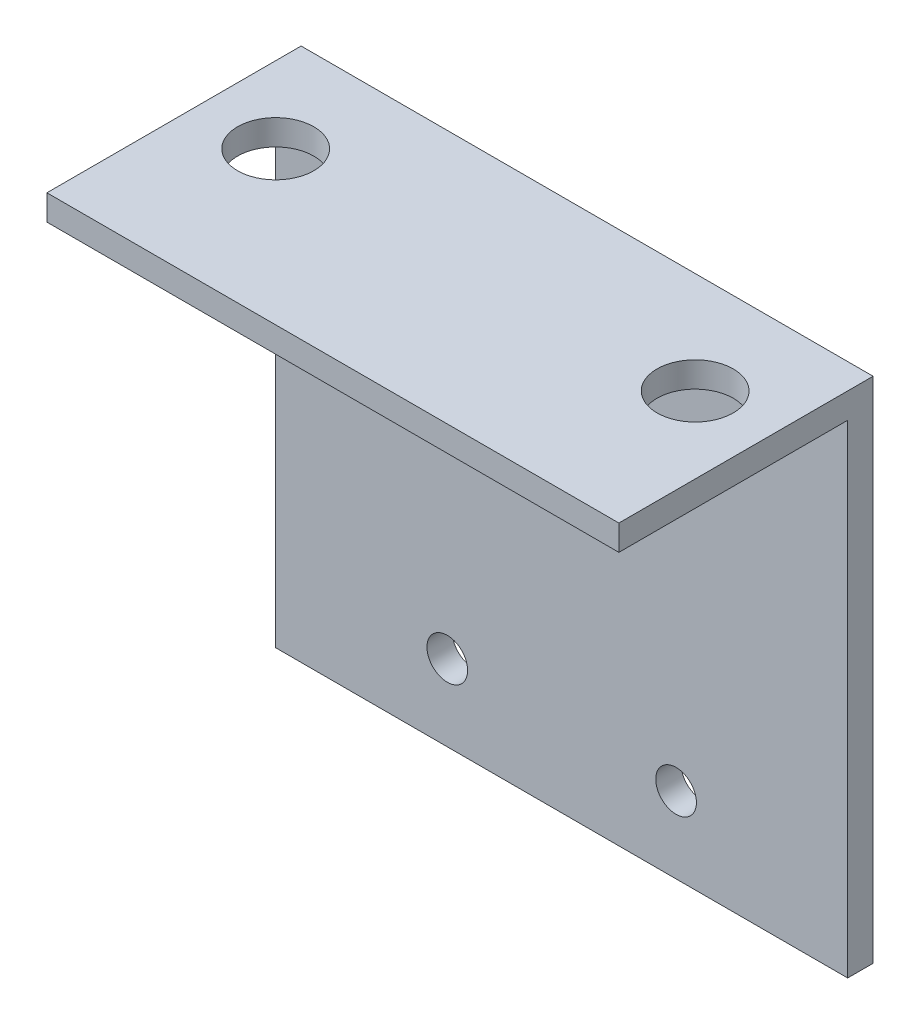
ISO-10303-21;
HEADER;
FILE_DESCRIPTION(('STEP AP214'),'2;1');
FILE_NAME('part.step','',(''),(''),'','','');
FILE_SCHEMA(('AUTOMOTIVE_DESIGN { 1 0 10303 214 1 1 1 1 }'));
ENDSEC;
DATA;
#1=APPLICATION_CONTEXT('core data for automotive mechanical design processes');
#2=APPLICATION_PROTOCOL_DEFINITION('international standard','automotive_design',2000,#1);
#3=PRODUCT_CONTEXT('',#1,'mechanical');
#4=PRODUCT('Part','Part','',(#3));
#5=PRODUCT_RELATED_PRODUCT_CATEGORY('part','',(#4));
#6=PRODUCT_DEFINITION_FORMATION('','',#4);
#7=PRODUCT_DEFINITION_CONTEXT('part definition',#1,'design');
#8=PRODUCT_DEFINITION('design','',#6,#7);
#9=PRODUCT_DEFINITION_SHAPE('','',#8);
#10=(LENGTH_UNIT() NAMED_UNIT(*) SI_UNIT(.MILLI.,.METRE.));
#11=(NAMED_UNIT(*) PLANE_ANGLE_UNIT() SI_UNIT($,.RADIAN.));
#12=(NAMED_UNIT(*) SI_UNIT($,.STERADIAN.) SOLID_ANGLE_UNIT());
#13=UNCERTAINTY_MEASURE_WITH_UNIT(LENGTH_MEASURE(1.E-05),#10,'distance_accuracy_value','');
#14=(GEOMETRIC_REPRESENTATION_CONTEXT(3) GLOBAL_UNCERTAINTY_ASSIGNED_CONTEXT((#13)) GLOBAL_UNIT_ASSIGNED_CONTEXT((#10,
#11,#12)) REPRESENTATION_CONTEXT('',''));
#15=CARTESIAN_POINT('',(0.,0.,0.));
#16=DIRECTION('',(0.,0.,1.));
#17=DIRECTION('',(1.,0.,0.));
#18=AXIS2_PLACEMENT_3D('',#15,#16,#17);
#19=CARTESIAN_POINT('',(45.,40.,-2.));
#20=DIRECTION('',(0.,-1.,0.));
#21=DIRECTION('',(0.,0.,-1.));
#22=AXIS2_PLACEMENT_3D('',#19,#20,#21);
#23=PLANE('',#22);
#24=CARTESIAN_POINT('',(39.,40.,6.));
#25=DIRECTION('',(0.,-1.,0.));
#26=DIRECTION('',(0.,0.,-1.));
#27=AXIS2_PLACEMENT_3D('',#24,#25,#26);
#28=CIRCLE('',#27,3.);
#29=CARTESIAN_POINT('',(39.,40.,3.));
#30=VERTEX_POINT('',#29);
#31=EDGE_CURVE('E122',#30,#30,#28,.T.);
#32=ORIENTED_EDGE('',*,*,#31,.T.);
#33=EDGE_LOOP('',(#32));
#34=FACE_BOUND('',#33,.T.);
#35=CARTESIAN_POINT('',(6.,40.,6.));
#36=DIRECTION('',(0.,-1.,0.));
#37=DIRECTION('',(0.,0.,-1.));
#38=AXIS2_PLACEMENT_3D('',#35,#36,#37);
#39=CIRCLE('',#38,3.);
#40=CARTESIAN_POINT('',(6.,40.,3.));
#41=VERTEX_POINT('',#40);
#42=EDGE_CURVE('E166',#41,#41,#39,.T.);
#43=ORIENTED_EDGE('',*,*,#42,.T.);
#44=EDGE_LOOP('',(#43));
#45=FACE_BOUND('',#44,.T.);
#46=DIRECTION('',(0.,0.,1.));
#47=VECTOR('',#46,1.);
#48=CARTESIAN_POINT('',(0.,40.,-2.));
#49=LINE('',#48,#47);
#50=CARTESIAN_POINT('',(0.,40.,-2.));
#51=VERTEX_POINT('',#50);
#52=CARTESIAN_POINT('',(0.,40.,18.));
#53=VERTEX_POINT('',#52);
#54=EDGE_CURVE('E118',#51,#53,#49,.T.);
#55=ORIENTED_EDGE('',*,*,#54,.T.);
#56=DIRECTION('',(-1.,0.,0.));
#57=VECTOR('',#56,1.);
#58=CARTESIAN_POINT('',(45.,40.,18.));
#59=LINE('',#58,#57);
#60=CARTESIAN_POINT('',(45.,40.,18.));
#61=VERTEX_POINT('',#60);
#62=EDGE_CURVE('E11',#61,#53,#59,.T.);
#63=ORIENTED_EDGE('',*,*,#62,.F.);
#64=DIRECTION('',(0.,0.,1.));
#65=VECTOR('',#64,1.);
#66=CARTESIAN_POINT('',(45.,40.,-2.));
#67=LINE('',#66,#65);
#68=CARTESIAN_POINT('',(45.,40.,-2.));
#69=VERTEX_POINT('',#68);
#70=EDGE_CURVE('E129',#69,#61,#67,.T.);
#71=ORIENTED_EDGE('',*,*,#70,.F.);
#72=DIRECTION('',(-1.,0.,0.));
#73=VECTOR('',#72,1.);
#74=CARTESIAN_POINT('',(45.,40.,-2.));
#75=LINE('',#74,#73);
#76=EDGE_CURVE('E114',#69,#51,#75,.T.);
#77=ORIENTED_EDGE('',*,*,#76,.T.);
#78=EDGE_LOOP('',(#55,#63,#71,#77));
#79=FACE_BOUND('',#78,.T.);
#80=ADVANCED_FACE('F34',(#34,#45,#79),#23,.F.);
#81=CARTESIAN_POINT('',(45.,40.,18.));
#82=DIRECTION('',(0.,0.,-1.));
#83=DIRECTION('',(-1.,0.,0.));
#84=AXIS2_PLACEMENT_3D('',#81,#82,#83);
#85=PLANE('',#84);
#86=DIRECTION('',(0.,-1.,0.));
#87=VECTOR('',#86,1.);
#88=CARTESIAN_POINT('',(0.,40.,18.));
#89=LINE('',#88,#87);
#90=CARTESIAN_POINT('',(0.,38.,18.));
#91=VERTEX_POINT('',#90);
#92=EDGE_CURVE('E121',#53,#91,#89,.T.);
#93=ORIENTED_EDGE('',*,*,#92,.T.);
#94=DIRECTION('',(-1.,0.,0.));
#95=VECTOR('',#94,1.);
#96=CARTESIAN_POINT('',(45.,38.,18.));
#97=LINE('',#96,#95);
#98=CARTESIAN_POINT('',(45.,38.,18.));
#99=VERTEX_POINT('',#98);
#100=EDGE_CURVE('E42',#99,#91,#97,.T.);
#101=ORIENTED_EDGE('',*,*,#100,.F.);
#102=DIRECTION('',(0.,-1.,0.));
#103=VECTOR('',#102,1.);
#104=CARTESIAN_POINT('',(45.,40.,18.));
#105=LINE('',#104,#103);
#106=EDGE_CURVE('E87',#61,#99,#105,.T.);
#107=ORIENTED_EDGE('',*,*,#106,.F.);
#108=ORIENTED_EDGE('',*,*,#62,.T.);
#109=EDGE_LOOP('',(#93,#101,#107,#108));
#110=FACE_BOUND('',#109,.T.);
#111=ADVANCED_FACE('F156',(#110),#85,.F.);
#112=CARTESIAN_POINT('',(45.,38.,18.));
#113=DIRECTION('',(0.,1.,0.));
#114=DIRECTION('',(0.,0.,1.));
#115=AXIS2_PLACEMENT_3D('',#112,#113,#114);
#116=PLANE('',#115);
#117=CARTESIAN_POINT('',(39.,38.,6.));
#118=DIRECTION('',(0.,-1.,0.));
#119=DIRECTION('',(0.,0.,-1.));
#120=AXIS2_PLACEMENT_3D('',#117,#118,#119);
#121=CIRCLE('',#120,3.);
#122=CARTESIAN_POINT('',(39.,38.,3.));
#123=VERTEX_POINT('',#122);
#124=EDGE_CURVE('E168',#123,#123,#121,.T.);
#125=ORIENTED_EDGE('',*,*,#124,.F.);
#126=EDGE_LOOP('',(#125));
#127=FACE_BOUND('',#126,.T.);
#128=CARTESIAN_POINT('',(6.,38.,6.));
#129=DIRECTION('',(0.,-1.,0.));
#130=DIRECTION('',(0.,0.,-1.));
#131=AXIS2_PLACEMENT_3D('',#128,#129,#130);
#132=CIRCLE('',#131,3.);
#133=CARTESIAN_POINT('',(6.,38.,3.));
#134=VERTEX_POINT('',#133);
#135=EDGE_CURVE('E169',#134,#134,#132,.T.);
#136=ORIENTED_EDGE('',*,*,#135,.F.);
#137=EDGE_LOOP('',(#136));
#138=FACE_BOUND('',#137,.T.);
#139=DIRECTION('',(0.,0.,-1.));
#140=VECTOR('',#139,1.);
#141=CARTESIAN_POINT('',(0.,38.,18.));
#142=LINE('',#141,#140);
#143=CARTESIAN_POINT('',(0.,38.,0.));
#144=VERTEX_POINT('',#143);
#145=EDGE_CURVE('E124',#91,#144,#142,.T.);
#146=ORIENTED_EDGE('',*,*,#145,.T.);
#147=DIRECTION('',(-1.,0.,0.));
#148=VECTOR('',#147,1.);
#149=CARTESIAN_POINT('',(45.,38.,0.));
#150=LINE('',#149,#148);
#151=CARTESIAN_POINT('',(45.,38.,0.));
#152=VERTEX_POINT('',#151);
#153=EDGE_CURVE('E109',#152,#144,#150,.T.);
#154=ORIENTED_EDGE('',*,*,#153,.F.);
#155=DIRECTION('',(0.,0.,-1.));
#156=VECTOR('',#155,1.);
#157=CARTESIAN_POINT('',(45.,38.,18.));
#158=LINE('',#157,#156);
#159=EDGE_CURVE('E100',#99,#152,#158,.T.);
#160=ORIENTED_EDGE('',*,*,#159,.F.);
#161=ORIENTED_EDGE('',*,*,#100,.T.);
#162=EDGE_LOOP('',(#146,#154,#160,#161));
#163=FACE_BOUND('',#162,.T.);
#164=ADVANCED_FACE('F135',(#127,#138,#163),#116,.F.);
#165=CARTESIAN_POINT('',(45.,38.,0.));
#166=DIRECTION('',(0.,0.,-1.));
#167=DIRECTION('',(-1.,0.,0.));
#168=AXIS2_PLACEMENT_3D('',#165,#166,#167);
#169=PLANE('',#168);
#170=CARTESIAN_POINT('',(13.5,6.,0.));
#171=DIRECTION('',(0.,0.,1.));
#172=DIRECTION('',(1.,0.,0.));
#173=AXIS2_PLACEMENT_3D('',#170,#171,#172);
#174=CIRCLE('',#173,1.6);
#175=CARTESIAN_POINT('',(15.1,6.,0.));
#176=VERTEX_POINT('',#175);
#177=EDGE_CURVE('E192',#176,#176,#174,.T.);
#178=ORIENTED_EDGE('',*,*,#177,.F.);
#179=EDGE_LOOP('',(#178));
#180=FACE_BOUND('',#179,.T.);
#181=CARTESIAN_POINT('',(31.5,6.,0.));
#182=DIRECTION('',(0.,0.,1.));
#183=DIRECTION('',(1.,0.,0.));
#184=AXIS2_PLACEMENT_3D('',#181,#182,#183);
#185=CIRCLE('',#184,1.6);
#186=CARTESIAN_POINT('',(33.1,6.,0.));
#187=VERTEX_POINT('',#186);
#188=EDGE_CURVE('E186',#187,#187,#185,.T.);
#189=ORIENTED_EDGE('',*,*,#188,.F.);
#190=EDGE_LOOP('',(#189));
#191=FACE_BOUND('',#190,.T.);
#192=CARTESIAN_POINT('',(22.5,25.,0.));
#193=DIRECTION('',(0.,0.,1.));
#194=DIRECTION('',(1.,0.,0.));
#195=AXIS2_PLACEMENT_3D('',#192,#193,#194);
#196=CIRCLE('',#195,2.6);
#197=CARTESIAN_POINT('',(25.1,25.,0.));
#198=VERTEX_POINT('',#197);
#199=EDGE_CURVE('E180',#198,#198,#196,.T.);
#200=ORIENTED_EDGE('',*,*,#199,.F.);
#201=EDGE_LOOP('',(#200));
#202=FACE_BOUND('',#201,.T.);
#203=DIRECTION('',(0.,-1.,0.));
#204=VECTOR('',#203,1.);
#205=CARTESIAN_POINT('',(0.,38.,0.));
#206=LINE('',#205,#204);
#207=CARTESIAN_POINT('',(0.,0.,0.));
#208=VERTEX_POINT('',#207);
#209=EDGE_CURVE('E108',#144,#208,#206,.T.);
#210=ORIENTED_EDGE('',*,*,#209,.T.);
#211=DIRECTION('',(-1.,0.,0.));
#212=VECTOR('',#211,1.);
#213=CARTESIAN_POINT('',(45.,0.,0.));
#214=LINE('',#213,#212);
#215=CARTESIAN_POINT('',(45.,0.,0.));
#216=VERTEX_POINT('',#215);
#217=EDGE_CURVE('E105',#216,#208,#214,.T.);
#218=ORIENTED_EDGE('',*,*,#217,.F.);
#219=DIRECTION('',(0.,-1.,0.));
#220=VECTOR('',#219,1.);
#221=CARTESIAN_POINT('',(45.,38.,0.));
#222=LINE('',#221,#220);
#223=EDGE_CURVE('E94',#152,#216,#222,.T.);
#224=ORIENTED_EDGE('',*,*,#223,.F.);
#225=ORIENTED_EDGE('',*,*,#153,.T.);
#226=EDGE_LOOP('',(#210,#218,#224,#225));
#227=FACE_BOUND('',#226,.T.);
#228=ADVANCED_FACE('F106',(#180,#191,#202,#227),#169,.F.);
#229=CARTESIAN_POINT('',(45.,0.,0.));
#230=DIRECTION('',(0.,1.,0.));
#231=DIRECTION('',(0.,0.,1.));
#232=AXIS2_PLACEMENT_3D('',#229,#230,#231);
#233=PLANE('',#232);
#234=DIRECTION('',(0.,0.,-1.));
#235=VECTOR('',#234,1.);
#236=CARTESIAN_POINT('',(0.,0.,0.));
#237=LINE('',#236,#235);
#238=CARTESIAN_POINT('',(0.,0.,-2.));
#239=VERTEX_POINT('',#238);
#240=EDGE_CURVE('E73',#208,#239,#237,.T.);
#241=ORIENTED_EDGE('',*,*,#240,.T.);
#242=DIRECTION('',(-1.,0.,0.));
#243=VECTOR('',#242,1.);
#244=CARTESIAN_POINT('',(45.,0.,-2.));
#245=LINE('',#244,#243);
#246=CARTESIAN_POINT('',(45.,0.,-2.));
#247=VERTEX_POINT('',#246);
#248=EDGE_CURVE('E110',#247,#239,#245,.T.);
#249=ORIENTED_EDGE('',*,*,#248,.F.);
#250=DIRECTION('',(0.,0.,-1.));
#251=VECTOR('',#250,1.);
#252=CARTESIAN_POINT('',(45.,0.,0.));
#253=LINE('',#252,#251);
#254=EDGE_CURVE('E98',#216,#247,#253,.T.);
#255=ORIENTED_EDGE('',*,*,#254,.F.);
#256=ORIENTED_EDGE('',*,*,#217,.T.);
#257=EDGE_LOOP('',(#241,#249,#255,#256));
#258=FACE_BOUND('',#257,.T.);
#259=ADVANCED_FACE('F112',(#258),#233,.F.);
#260=CARTESIAN_POINT('',(45.,0.,-2.));
#261=DIRECTION('',(0.,0.,1.));
#262=DIRECTION('',(1.,0.,0.));
#263=AXIS2_PLACEMENT_3D('',#260,#261,#262);
#264=PLANE('',#263);
#265=CARTESIAN_POINT('',(13.5,6.,-2.));
#266=DIRECTION('',(0.,0.,1.));
#267=DIRECTION('',(1.,0.,0.));
#268=AXIS2_PLACEMENT_3D('',#265,#266,#267);
#269=CIRCLE('',#268,1.6);
#270=CARTESIAN_POINT('',(15.1,6.,-2.));
#271=VERTEX_POINT('',#270);
#272=EDGE_CURVE('E183',#271,#271,#269,.T.);
#273=ORIENTED_EDGE('',*,*,#272,.T.);
#274=EDGE_LOOP('',(#273));
#275=FACE_BOUND('',#274,.T.);
#276=CARTESIAN_POINT('',(31.5,6.,-2.));
#277=DIRECTION('',(0.,0.,1.));
#278=DIRECTION('',(1.,0.,0.));
#279=AXIS2_PLACEMENT_3D('',#276,#277,#278);
#280=CIRCLE('',#279,1.6);
#281=CARTESIAN_POINT('',(33.1,6.,-2.));
#282=VERTEX_POINT('',#281);
#283=EDGE_CURVE('E189',#282,#282,#280,.T.);
#284=ORIENTED_EDGE('',*,*,#283,.T.);
#285=EDGE_LOOP('',(#284));
#286=FACE_BOUND('',#285,.T.);
#287=CARTESIAN_POINT('',(22.5,25.,-2.));
#288=DIRECTION('',(0.,0.,1.));
#289=DIRECTION('',(1.,0.,0.));
#290=AXIS2_PLACEMENT_3D('',#287,#288,#289);
#291=CIRCLE('',#290,2.6);
#292=CARTESIAN_POINT('',(25.1,25.,-2.));
#293=VERTEX_POINT('',#292);
#294=EDGE_CURVE('E174',#293,#293,#291,.T.);
#295=ORIENTED_EDGE('',*,*,#294,.T.);
#296=EDGE_LOOP('',(#295));
#297=FACE_BOUND('',#296,.T.);
#298=DIRECTION('',(0.,1.,0.));
#299=VECTOR('',#298,1.);
#300=CARTESIAN_POINT('',(0.,0.,-2.));
#301=LINE('',#300,#299);
#302=EDGE_CURVE('E79',#239,#51,#301,.T.);
#303=ORIENTED_EDGE('',*,*,#302,.T.);
#304=ORIENTED_EDGE('',*,*,#76,.F.);
#305=DIRECTION('',(0.,1.,0.));
#306=VECTOR('',#305,1.);
#307=CARTESIAN_POINT('',(45.,0.,-2.));
#308=LINE('',#307,#306);
#309=EDGE_CURVE('E50',#247,#69,#308,.T.);
#310=ORIENTED_EDGE('',*,*,#309,.F.);
#311=ORIENTED_EDGE('',*,*,#248,.T.);
#312=EDGE_LOOP('',(#303,#304,#310,#311));
#313=FACE_BOUND('',#312,.T.);
#314=ADVANCED_FACE('F142',(#275,#286,#297,#313),#264,.F.);
#315=CARTESIAN_POINT('',(45.,0.,0.));
#316=DIRECTION('',(1.,0.,0.));
#317=DIRECTION('',(0.,0.,-1.));
#318=AXIS2_PLACEMENT_3D('',#315,#316,#317);
#319=PLANE('',#318);
#320=ORIENTED_EDGE('',*,*,#70,.T.);
#321=ORIENTED_EDGE('',*,*,#106,.T.);
#322=ORIENTED_EDGE('',*,*,#159,.T.);
#323=ORIENTED_EDGE('',*,*,#223,.T.);
#324=ORIENTED_EDGE('',*,*,#254,.T.);
#325=ORIENTED_EDGE('',*,*,#309,.T.);
#326=EDGE_LOOP('',(#320,#321,#322,#323,#324,#325));
#327=FACE_BOUND('',#326,.T.);
#328=ADVANCED_FACE('F96',(#327),#319,.T.);
#329=CARTESIAN_POINT('',(0.,0.,0.));
#330=DIRECTION('',(1.,0.,0.));
#331=DIRECTION('',(0.,0.,-1.));
#332=AXIS2_PLACEMENT_3D('',#329,#330,#331);
#333=PLANE('',#332);
#334=ORIENTED_EDGE('',*,*,#54,.F.);
#335=ORIENTED_EDGE('',*,*,#302,.F.);
#336=ORIENTED_EDGE('',*,*,#240,.F.);
#337=ORIENTED_EDGE('',*,*,#209,.F.);
#338=ORIENTED_EDGE('',*,*,#145,.F.);
#339=ORIENTED_EDGE('',*,*,#92,.F.);
#340=EDGE_LOOP('',(#334,#335,#336,#337,#338,#339));
#341=FACE_BOUND('',#340,.T.);
#342=ADVANCED_FACE('F138',(#341),#333,.F.);
#343=CARTESIAN_POINT('',(6.,40.,6.));
#344=DIRECTION('',(0.,-1.,0.));
#345=DIRECTION('',(0.,0.,-1.));
#346=AXIS2_PLACEMENT_3D('',#343,#344,#345);
#347=CYLINDRICAL_SURFACE('',#346,3.);
#348=ORIENTED_EDGE('',*,*,#42,.F.);
#349=EDGE_LOOP('',(#348));
#350=FACE_BOUND('',#349,.T.);
#351=ORIENTED_EDGE('',*,*,#135,.T.);
#352=EDGE_LOOP('',(#351));
#353=FACE_BOUND('',#352,.T.);
#354=ADVANCED_FACE('F222',(#350,#353),#347,.F.);
#355=CARTESIAN_POINT('',(39.,40.,6.));
#356=DIRECTION('',(0.,-1.,0.));
#357=DIRECTION('',(0.,0.,-1.));
#358=AXIS2_PLACEMENT_3D('',#355,#356,#357);
#359=CYLINDRICAL_SURFACE('',#358,3.);
#360=ORIENTED_EDGE('',*,*,#31,.F.);
#361=EDGE_LOOP('',(#360));
#362=FACE_BOUND('',#361,.T.);
#363=ORIENTED_EDGE('',*,*,#124,.T.);
#364=EDGE_LOOP('',(#363));
#365=FACE_BOUND('',#364,.T.);
#366=ADVANCED_FACE('F213',(#362,#365),#359,.F.);
#367=CARTESIAN_POINT('',(22.5,25.,-2.));
#368=DIRECTION('',(0.,0.,1.));
#369=DIRECTION('',(1.,0.,0.));
#370=AXIS2_PLACEMENT_3D('',#367,#368,#369);
#371=CYLINDRICAL_SURFACE('',#370,2.6);
#372=ORIENTED_EDGE('',*,*,#294,.F.);
#373=EDGE_LOOP('',(#372));
#374=FACE_BOUND('',#373,.T.);
#375=ORIENTED_EDGE('',*,*,#199,.T.);
#376=EDGE_LOOP('',(#375));
#377=FACE_BOUND('',#376,.T.);
#378=ADVANCED_FACE('F211',(#374,#377),#371,.F.);
#379=CARTESIAN_POINT('',(31.5,6.,-2.));
#380=DIRECTION('',(0.,0.,1.));
#381=DIRECTION('',(1.,0.,0.));
#382=AXIS2_PLACEMENT_3D('',#379,#380,#381);
#383=CYLINDRICAL_SURFACE('',#382,1.6);
#384=ORIENTED_EDGE('',*,*,#283,.F.);
#385=EDGE_LOOP('',(#384));
#386=FACE_BOUND('',#385,.T.);
#387=ORIENTED_EDGE('',*,*,#188,.T.);
#388=EDGE_LOOP('',(#387));
#389=FACE_BOUND('',#388,.T.);
#390=ADVANCED_FACE('F200',(#386,#389),#383,.F.);
#391=CARTESIAN_POINT('',(13.5,6.,-2.));
#392=DIRECTION('',(0.,0.,1.));
#393=DIRECTION('',(1.,0.,0.));
#394=AXIS2_PLACEMENT_3D('',#391,#392,#393);
#395=CYLINDRICAL_SURFACE('',#394,1.6);
#396=ORIENTED_EDGE('',*,*,#272,.F.);
#397=EDGE_LOOP('',(#396));
#398=FACE_BOUND('',#397,.T.);
#399=ORIENTED_EDGE('',*,*,#177,.T.);
#400=EDGE_LOOP('',(#399));
#401=FACE_BOUND('',#400,.T.);
#402=ADVANCED_FACE('F197',(#398,#401),#395,.F.);
#403=CLOSED_SHELL('',(#80,#111,#164,#228,#259,#314,#328,#342,#354,#366,#378,#390,#402));
#404=MANIFOLD_SOLID_BREP('B2',#403);
#405=ADVANCED_BREP_SHAPE_REPRESENTATION('',(#18,#404),#14);
#406=SHAPE_DEFINITION_REPRESENTATION(#9,#405);
ENDSEC;
END-ISO-10303-21;
